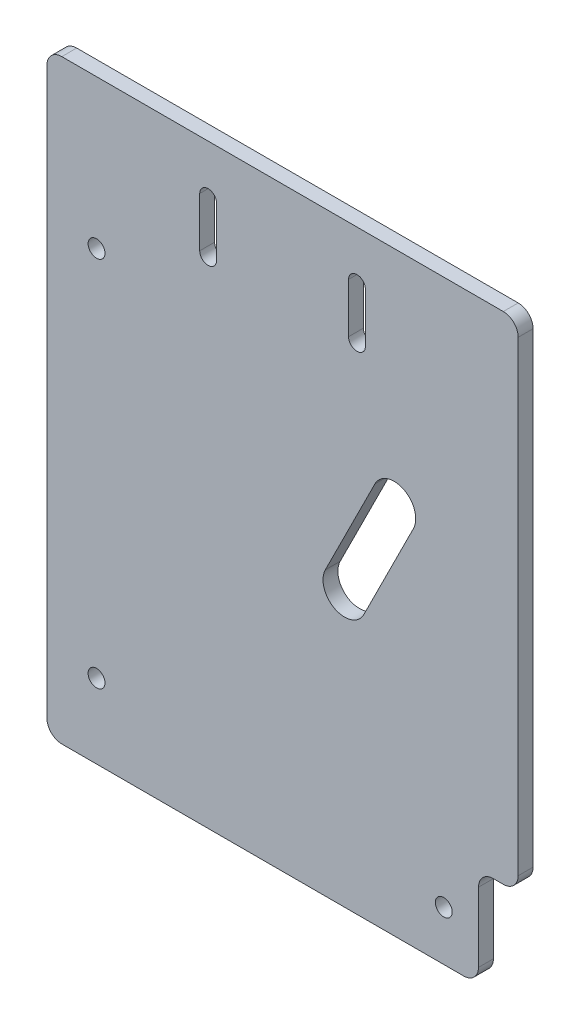
ISO-10303-21;
HEADER;
FILE_DESCRIPTION(('STEP AP214'),'2;1');
FILE_NAME('part.step','',(''),(''),'','','');
FILE_SCHEMA(('AUTOMOTIVE_DESIGN { 1 0 10303 214 1 1 1 1 }'));
ENDSEC;
DATA;
#1=APPLICATION_CONTEXT('core data for automotive mechanical design processes');
#2=APPLICATION_PROTOCOL_DEFINITION('international standard','automotive_design',2000,#1);
#3=PRODUCT_CONTEXT('',#1,'mechanical');
#4=PRODUCT('Part','Part','',(#3));
#5=PRODUCT_RELATED_PRODUCT_CATEGORY('part','',(#4));
#6=PRODUCT_DEFINITION_FORMATION('','',#4);
#7=PRODUCT_DEFINITION_CONTEXT('part definition',#1,'design');
#8=PRODUCT_DEFINITION('design','',#6,#7);
#9=PRODUCT_DEFINITION_SHAPE('','',#8);
#10=(LENGTH_UNIT() NAMED_UNIT(*) SI_UNIT(.MILLI.,.METRE.));
#11=(NAMED_UNIT(*) PLANE_ANGLE_UNIT() SI_UNIT($,.RADIAN.));
#12=(NAMED_UNIT(*) SI_UNIT($,.STERADIAN.) SOLID_ANGLE_UNIT());
#13=UNCERTAINTY_MEASURE_WITH_UNIT(LENGTH_MEASURE(1.E-05),#10,'distance_accuracy_value','');
#14=(GEOMETRIC_REPRESENTATION_CONTEXT(3) GLOBAL_UNCERTAINTY_ASSIGNED_CONTEXT((#13)) GLOBAL_UNIT_ASSIGNED_CONTEXT((#10,
#11,#12)) REPRESENTATION_CONTEXT('',''));
#15=CARTESIAN_POINT('',(0.,0.,0.));
#16=DIRECTION('',(0.,0.,1.));
#17=DIRECTION('',(1.,0.,0.));
#18=AXIS2_PLACEMENT_3D('',#15,#16,#17);
#19=CARTESIAN_POINT('',(70.,-45.,3.));
#20=DIRECTION('',(0.,0.,-1.));
#21=DIRECTION('',(-1.,0.,0.));
#22=AXIS2_PLACEMENT_3D('',#19,#20,#21);
#23=CYLINDRICAL_SURFACE('',#22,4.35);
#24=CARTESIAN_POINT('',(70.,-45.,0.));
#25=DIRECTION('',(0.,0.,1.));
#26=DIRECTION('',(1.,0.,0.));
#27=AXIS2_PLACEMENT_3D('',#24,#25,#26);
#28=CIRCLE('',#27,4.35);
#29=CARTESIAN_POINT('',(73.8907582808497,-46.9453791404248,0.));
#30=VERTEX_POINT('',#29);
#31=CARTESIAN_POINT('',(66.1092417191503,-43.0546208595752,0.));
#32=VERTEX_POINT('',#31);
#33=EDGE_CURVE('E310',#30,#32,#28,.T.);
#34=ORIENTED_EDGE('',*,*,#33,.F.);
#35=DIRECTION('',(0.,0.,-1.));
#36=VECTOR('',#35,1.);
#37=CARTESIAN_POINT('',(73.8907582808497,-46.9453791404248,3.));
#38=LINE('',#37,#36);
#39=CARTESIAN_POINT('',(73.8907582808497,-46.9453791404248,3.));
#40=VERTEX_POINT('',#39);
#41=EDGE_CURVE('E326',#40,#30,#38,.T.);
#42=ORIENTED_EDGE('',*,*,#41,.F.);
#43=CARTESIAN_POINT('',(70.,-45.,3.));
#44=DIRECTION('',(0.,0.,1.));
#45=DIRECTION('',(1.,0.,0.));
#46=AXIS2_PLACEMENT_3D('',#43,#44,#45);
#47=CIRCLE('',#46,4.35);
#48=CARTESIAN_POINT('',(66.1092417191503,-43.0546208595752,3.));
#49=VERTEX_POINT('',#48);
#50=EDGE_CURVE('E278',#40,#49,#47,.T.);
#51=ORIENTED_EDGE('',*,*,#50,.T.);
#52=DIRECTION('',(0.,0.,-1.));
#53=VECTOR('',#52,1.);
#54=CARTESIAN_POINT('',(66.1092417191503,-43.0546208595752,3.));
#55=LINE('',#54,#53);
#56=EDGE_CURVE('E290',#49,#32,#55,.T.);
#57=ORIENTED_EDGE('',*,*,#56,.T.);
#58=EDGE_LOOP('',(#34,#42,#51,#57));
#59=FACE_BOUND('',#58,.T.);
#60=ADVANCED_FACE('F37',(#59),#23,.F.);
#61=CARTESIAN_POINT('',(77.8907582808496,-38.9453791404248,3.));
#62=DIRECTION('',(-0.894427190999916,0.447213595499958,0.));
#63=DIRECTION('',(-0.447213595499958,-0.894427190999916,0.));
#64=AXIS2_PLACEMENT_3D('',#61,#62,#63);
#65=PLANE('',#64);
#66=DIRECTION('',(0.447213595499958,0.894427190999916,0.));
#67=VECTOR('',#66,1.);
#68=CARTESIAN_POINT('',(77.8907582808496,-38.9453791404248,0.));
#69=LINE('',#68,#67);
#70=CARTESIAN_POINT('',(63.8907582808496,-66.9453791404248,0.));
#71=VERTEX_POINT('',#70);
#72=EDGE_CURVE('E313',#71,#30,#69,.T.);
#73=ORIENTED_EDGE('',*,*,#72,.F.);
#74=DIRECTION('',(0.,0.,-1.));
#75=VECTOR('',#74,1.);
#76=CARTESIAN_POINT('',(63.8907582808496,-66.9453791404248,3.));
#77=LINE('',#76,#75);
#78=CARTESIAN_POINT('',(63.8907582808496,-66.9453791404248,3.));
#79=VERTEX_POINT('',#78);
#80=EDGE_CURVE('E324',#79,#71,#77,.T.);
#81=ORIENTED_EDGE('',*,*,#80,.F.);
#82=DIRECTION('',(0.447213595499958,0.894427190999916,0.));
#83=VECTOR('',#82,1.);
#84=CARTESIAN_POINT('',(77.8907582808496,-38.9453791404248,3.));
#85=LINE('',#84,#83);
#86=EDGE_CURVE('E281',#79,#40,#85,.T.);
#87=ORIENTED_EDGE('',*,*,#86,.T.);
#88=ORIENTED_EDGE('',*,*,#41,.T.);
#89=EDGE_LOOP('',(#73,#81,#87,#88));
#90=FACE_BOUND('',#89,.T.);
#91=ADVANCED_FACE('F462',(#90),#65,.T.);
#92=CARTESIAN_POINT('',(60.,-65.,3.));
#93=DIRECTION('',(0.,0.,-1.));
#94=DIRECTION('',(-1.,0.,0.));
#95=AXIS2_PLACEMENT_3D('',#92,#93,#94);
#96=CYLINDRICAL_SURFACE('',#95,4.34999999999999);
#97=CARTESIAN_POINT('',(60.,-65.,0.));
#98=DIRECTION('',(0.,0.,1.));
#99=DIRECTION('',(1.,0.,0.));
#100=AXIS2_PLACEMENT_3D('',#97,#98,#99);
#101=CIRCLE('',#100,4.34999999999999);
#102=CARTESIAN_POINT('',(56.1092417191504,-63.0546208595752,0.));
#103=VERTEX_POINT('',#102);
#104=EDGE_CURVE('E316',#103,#71,#101,.T.);
#105=ORIENTED_EDGE('',*,*,#104,.F.);
#106=DIRECTION('',(0.,0.,-1.));
#107=VECTOR('',#106,1.);
#108=CARTESIAN_POINT('',(56.1092417191504,-63.0546208595752,3.));
#109=LINE('',#108,#107);
#110=CARTESIAN_POINT('',(56.1092417191504,-63.0546208595752,3.));
#111=VERTEX_POINT('',#110);
#112=EDGE_CURVE('E322',#111,#103,#109,.T.);
#113=ORIENTED_EDGE('',*,*,#112,.F.);
#114=CARTESIAN_POINT('',(60.,-65.,3.));
#115=DIRECTION('',(0.,0.,1.));
#116=DIRECTION('',(1.,0.,0.));
#117=AXIS2_PLACEMENT_3D('',#114,#115,#116);
#118=CIRCLE('',#117,4.34999999999999);
#119=EDGE_CURVE('E284',#111,#79,#118,.T.);
#120=ORIENTED_EDGE('',*,*,#119,.T.);
#121=ORIENTED_EDGE('',*,*,#80,.T.);
#122=EDGE_LOOP('',(#105,#113,#120,#121));
#123=FACE_BOUND('',#122,.T.);
#124=ADVANCED_FACE('F468',(#123),#96,.F.);
#125=CARTESIAN_POINT('',(0.,-120.,3.));
#126=DIRECTION('',(0.,1.,0.));
#127=DIRECTION('',(-1.,0.,0.));
#128=AXIS2_PLACEMENT_3D('',#125,#126,#127);
#129=PLANE('',#128);
#130=DIRECTION('',(1.,0.,0.));
#131=VECTOR('',#130,1.);
#132=CARTESIAN_POINT('',(0.,-120.,0.));
#133=LINE('',#132,#131);
#134=CARTESIAN_POINT('',(3.00000000000001,-120.,0.));
#135=VERTEX_POINT('',#134);
#136=CARTESIAN_POINT('',(84.,-120.,0.));
#137=VERTEX_POINT('',#136);
#138=EDGE_CURVE('E250',#135,#137,#133,.T.);
#139=ORIENTED_EDGE('',*,*,#138,.T.);
#140=DIRECTION('',(0.,0.,1.));
#141=VECTOR('',#140,1.);
#142=CARTESIAN_POINT('',(84.,-120.,3.));
#143=LINE('',#142,#141);
#144=CARTESIAN_POINT('',(84.,-120.,3.));
#145=VERTEX_POINT('',#144);
#146=EDGE_CURVE('E376',#137,#145,#143,.T.);
#147=ORIENTED_EDGE('',*,*,#146,.T.);
#148=DIRECTION('',(1.,0.,0.));
#149=VECTOR('',#148,1.);
#150=CARTESIAN_POINT('',(0.,-120.,3.));
#151=LINE('',#150,#149);
#152=CARTESIAN_POINT('',(3.00000000000001,-120.,3.));
#153=VERTEX_POINT('',#152);
#154=EDGE_CURVE('E257',#153,#145,#151,.T.);
#155=ORIENTED_EDGE('',*,*,#154,.F.);
#156=DIRECTION('',(0.,0.,-1.));
#157=VECTOR('',#156,1.);
#158=CARTESIAN_POINT('',(3.00000000000001,-120.,3.));
#159=LINE('',#158,#157);
#160=EDGE_CURVE('E336',#153,#135,#159,.T.);
#161=ORIENTED_EDGE('',*,*,#160,.T.);
#162=EDGE_LOOP('',(#139,#147,#155,#161));
#163=FACE_BOUND('',#162,.T.);
#164=ADVANCED_FACE('F428',(#163),#129,.F.);
#165=CARTESIAN_POINT('',(95.,0.,3.));
#166=DIRECTION('',(1.,0.,0.));
#167=DIRECTION('',(0.,1.,0.));
#168=AXIS2_PLACEMENT_3D('',#165,#166,#167);
#169=PLANE('',#168);
#170=DIRECTION('',(0.,-1.,0.));
#171=VECTOR('',#170,1.);
#172=CARTESIAN_POINT('',(95.,0.,3.));
#173=LINE('',#172,#171);
#174=CARTESIAN_POINT('',(95.,-3.,3.));
#175=VERTEX_POINT('',#174);
#176=CARTESIAN_POINT('',(95.,-97.,3.));
#177=VERTEX_POINT('',#176);
#178=EDGE_CURVE('E260',#175,#177,#173,.T.);
#179=ORIENTED_EDGE('',*,*,#178,.T.);
#180=DIRECTION('',(0.,0.,1.));
#181=VECTOR('',#180,1.);
#182=CARTESIAN_POINT('',(95.,-97.,0.));
#183=LINE('',#182,#181);
#184=CARTESIAN_POINT('',(95.,-97.,0.));
#185=VERTEX_POINT('',#184);
#186=EDGE_CURVE('E52',#177,#185,#183,.F.);
#187=ORIENTED_EDGE('',*,*,#186,.T.);
#188=DIRECTION('',(0.,-1.,0.));
#189=VECTOR('',#188,1.);
#190=CARTESIAN_POINT('',(95.,0.,0.));
#191=LINE('',#190,#189);
#192=CARTESIAN_POINT('',(95.,-3.,0.));
#193=VERTEX_POINT('',#192);
#194=EDGE_CURVE('E293',#193,#185,#191,.T.);
#195=ORIENTED_EDGE('',*,*,#194,.F.);
#196=DIRECTION('',(0.,0.,-1.));
#197=VECTOR('',#196,1.);
#198=CARTESIAN_POINT('',(95.,-3.,3.));
#199=LINE('',#198,#197);
#200=EDGE_CURVE('E328',#193,#175,#199,.F.);
#201=ORIENTED_EDGE('',*,*,#200,.T.);
#202=EDGE_LOOP('',(#179,#187,#195,#201));
#203=FACE_BOUND('',#202,.T.);
#204=ADVANCED_FACE('F454',(#203),#169,.T.);
#205=CARTESIAN_POINT('',(0.,0.,3.));
#206=DIRECTION('',(0.,1.,0.));
#207=DIRECTION('',(0.,0.,1.));
#208=AXIS2_PLACEMENT_3D('',#205,#206,#207);
#209=PLANE('',#208);
#210=DIRECTION('',(1.,0.,0.));
#211=VECTOR('',#210,1.);
#212=CARTESIAN_POINT('',(0.,0.,3.));
#213=LINE('',#212,#211);
#214=CARTESIAN_POINT('',(3.,0.,3.));
#215=VERTEX_POINT('',#214);
#216=CARTESIAN_POINT('',(92.,0.,3.));
#217=VERTEX_POINT('',#216);
#218=EDGE_CURVE('E263',#215,#217,#213,.T.);
#219=ORIENTED_EDGE('',*,*,#218,.T.);
#220=DIRECTION('',(0.,0.,-1.));
#221=VECTOR('',#220,1.);
#222=CARTESIAN_POINT('',(92.,0.,3.));
#223=LINE('',#222,#221);
#224=CARTESIAN_POINT('',(92.,0.,0.));
#225=VERTEX_POINT('',#224);
#226=EDGE_CURVE('E352',#217,#225,#223,.T.);
#227=ORIENTED_EDGE('',*,*,#226,.T.);
#228=DIRECTION('',(1.,0.,0.));
#229=VECTOR('',#228,1.);
#230=CARTESIAN_POINT('',(0.,0.,0.));
#231=LINE('',#230,#229);
#232=CARTESIAN_POINT('',(3.,0.,0.));
#233=VERTEX_POINT('',#232);
#234=EDGE_CURVE('E295',#233,#225,#231,.T.);
#235=ORIENTED_EDGE('',*,*,#234,.F.);
#236=DIRECTION('',(0.,0.,-1.));
#237=VECTOR('',#236,1.);
#238=CARTESIAN_POINT('',(3.,0.,3.));
#239=LINE('',#238,#237);
#240=EDGE_CURVE('E350',#233,#215,#239,.F.);
#241=ORIENTED_EDGE('',*,*,#240,.T.);
#242=EDGE_LOOP('',(#219,#227,#235,#241));
#243=FACE_BOUND('',#242,.T.);
#244=ADVANCED_FACE('F446',(#243),#209,.T.);
#245=CARTESIAN_POINT('',(80.,-110.,3.));
#246=DIRECTION('',(0.,0.,-1.));
#247=DIRECTION('',(-1.,0.,0.));
#248=AXIS2_PLACEMENT_3D('',#245,#246,#247);
#249=CYLINDRICAL_SURFACE('',#248,1.70000000000001);
#250=CARTESIAN_POINT('',(80.,-110.,3.));
#251=DIRECTION('',(0.,0.,1.));
#252=DIRECTION('',(1.,0.,0.));
#253=AXIS2_PLACEMENT_3D('',#250,#251,#252);
#254=CIRCLE('',#253,1.70000000000001);
#255=CARTESIAN_POINT('',(81.7,-110.,3.));
#256=VERTEX_POINT('',#255);
#257=EDGE_CURVE('E275',#256,#256,#254,.T.);
#258=ORIENTED_EDGE('',*,*,#257,.T.);
#259=EDGE_LOOP('',(#258));
#260=FACE_BOUND('',#259,.T.);
#261=CARTESIAN_POINT('',(80.,-110.,0.));
#262=DIRECTION('',(0.,0.,1.));
#263=DIRECTION('',(1.,0.,0.));
#264=AXIS2_PLACEMENT_3D('',#261,#262,#263);
#265=CIRCLE('',#264,1.70000000000001);
#266=CARTESIAN_POINT('',(81.7,-110.,0.));
#267=VERTEX_POINT('',#266);
#268=EDGE_CURVE('E307',#267,#267,#265,.T.);
#269=ORIENTED_EDGE('',*,*,#268,.F.);
#270=EDGE_LOOP('',(#269));
#271=FACE_BOUND('',#270,.T.);
#272=ADVANCED_FACE('F474',(#260,#271),#249,.F.);
#273=CARTESIAN_POINT('',(9.99999999999996,-30.,3.));
#274=DIRECTION('',(0.,0.,-1.));
#275=DIRECTION('',(-1.,0.,0.));
#276=AXIS2_PLACEMENT_3D('',#273,#274,#275);
#277=CYLINDRICAL_SURFACE('',#276,1.7);
#278=CARTESIAN_POINT('',(9.99999999999996,-30.,3.));
#279=DIRECTION('',(0.,0.,1.));
#280=DIRECTION('',(1.,0.,0.));
#281=AXIS2_PLACEMENT_3D('',#278,#279,#280);
#282=CIRCLE('',#281,1.7);
#283=CARTESIAN_POINT('',(11.7,-30.,3.));
#284=VERTEX_POINT('',#283);
#285=EDGE_CURVE('E272',#284,#284,#282,.T.);
#286=ORIENTED_EDGE('',*,*,#285,.T.);
#287=EDGE_LOOP('',(#286));
#288=FACE_BOUND('',#287,.T.);
#289=CARTESIAN_POINT('',(9.99999999999996,-30.,0.));
#290=DIRECTION('',(0.,0.,1.));
#291=DIRECTION('',(1.,0.,0.));
#292=AXIS2_PLACEMENT_3D('',#289,#290,#291);
#293=CIRCLE('',#292,1.7);
#294=CARTESIAN_POINT('',(11.7,-30.,0.));
#295=VERTEX_POINT('',#294);
#296=EDGE_CURVE('E304',#295,#295,#293,.T.);
#297=ORIENTED_EDGE('',*,*,#296,.F.);
#298=EDGE_LOOP('',(#297));
#299=FACE_BOUND('',#298,.T.);
#300=ADVANCED_FACE('F477',(#288,#299),#277,.F.);
#301=CARTESIAN_POINT('',(9.99999999999996,-105.,3.));
#302=DIRECTION('',(0.,0.,-1.));
#303=DIRECTION('',(-1.,0.,0.));
#304=AXIS2_PLACEMENT_3D('',#301,#302,#303);
#305=CYLINDRICAL_SURFACE('',#304,1.70000000000001);
#306=CARTESIAN_POINT('',(9.99999999999996,-105.,3.));
#307=DIRECTION('',(0.,0.,1.));
#308=DIRECTION('',(1.,0.,0.));
#309=AXIS2_PLACEMENT_3D('',#306,#307,#308);
#310=CIRCLE('',#309,1.70000000000001);
#311=CARTESIAN_POINT('',(11.7,-105.,3.));
#312=VERTEX_POINT('',#311);
#313=EDGE_CURVE('E269',#312,#312,#310,.T.);
#314=ORIENTED_EDGE('',*,*,#313,.T.);
#315=EDGE_LOOP('',(#314));
#316=FACE_BOUND('',#315,.T.);
#317=CARTESIAN_POINT('',(9.99999999999996,-105.,0.));
#318=DIRECTION('',(0.,0.,1.));
#319=DIRECTION('',(1.,0.,0.));
#320=AXIS2_PLACEMENT_3D('',#317,#318,#319);
#321=CIRCLE('',#320,1.70000000000001);
#322=CARTESIAN_POINT('',(11.7,-105.,0.));
#323=VERTEX_POINT('',#322);
#324=EDGE_CURVE('E301',#323,#323,#321,.T.);
#325=ORIENTED_EDGE('',*,*,#324,.F.);
#326=EDGE_LOOP('',(#325));
#327=FACE_BOUND('',#326,.T.);
#328=ADVANCED_FACE('F481',(#316,#327),#305,.F.);
#329=CARTESIAN_POINT('',(0.,0.,3.));
#330=DIRECTION('',(1.,0.,0.));
#331=DIRECTION('',(0.,1.,0.));
#332=AXIS2_PLACEMENT_3D('',#329,#330,#331);
#333=PLANE('',#332);
#334=DIRECTION('',(0.,-1.,0.));
#335=VECTOR('',#334,1.);
#336=CARTESIAN_POINT('',(0.,0.,0.));
#337=LINE('',#336,#335);
#338=CARTESIAN_POINT('',(0.,-3.,0.));
#339=VERTEX_POINT('',#338);
#340=CARTESIAN_POINT('',(0.,-117.,0.));
#341=VERTEX_POINT('',#340);
#342=EDGE_CURVE('E298',#339,#341,#337,.T.);
#343=ORIENTED_EDGE('',*,*,#342,.T.);
#344=DIRECTION('',(0.,0.,-1.));
#345=VECTOR('',#344,1.);
#346=CARTESIAN_POINT('',(0.,-117.,3.));
#347=LINE('',#346,#345);
#348=CARTESIAN_POINT('',(0.,-117.,3.));
#349=VERTEX_POINT('',#348);
#350=EDGE_CURVE('E348',#341,#349,#347,.F.);
#351=ORIENTED_EDGE('',*,*,#350,.T.);
#352=DIRECTION('',(0.,-1.,0.));
#353=VECTOR('',#352,1.);
#354=CARTESIAN_POINT('',(0.,0.,3.));
#355=LINE('',#354,#353);
#356=CARTESIAN_POINT('',(0.,-3.,3.));
#357=VERTEX_POINT('',#356);
#358=EDGE_CURVE('E266',#357,#349,#355,.T.);
#359=ORIENTED_EDGE('',*,*,#358,.F.);
#360=DIRECTION('',(0.,0.,-1.));
#361=VECTOR('',#360,1.);
#362=CARTESIAN_POINT('',(0.,-3.,0.));
#363=LINE('',#362,#361);
#364=EDGE_CURVE('E345',#357,#339,#363,.T.);
#365=ORIENTED_EDGE('',*,*,#364,.T.);
#366=EDGE_LOOP('',(#343,#351,#359,#365));
#367=FACE_BOUND('',#366,.T.);
#368=ADVANCED_FACE('F437',(#367),#333,.F.);
#369=CARTESIAN_POINT('',(70.1092417191504,-35.0546208595751,3.));
#370=DIRECTION('',(0.894427190999916,-0.447213595499957,0.));
#371=DIRECTION('',(0.447213595499957,0.894427190999916,0.));
#372=AXIS2_PLACEMENT_3D('',#369,#370,#371);
#373=PLANE('',#372);
#374=DIRECTION('',(-0.447213595499957,-0.894427190999916,0.));
#375=VECTOR('',#374,1.);
#376=CARTESIAN_POINT('',(70.1092417191504,-35.0546208595751,0.));
#377=LINE('',#376,#375);
#378=EDGE_CURVE('E261',#32,#103,#377,.T.);
#379=ORIENTED_EDGE('',*,*,#378,.F.);
#380=ORIENTED_EDGE('',*,*,#56,.F.);
#381=DIRECTION('',(-0.447213595499957,-0.894427190999916,0.));
#382=VECTOR('',#381,1.);
#383=CARTESIAN_POINT('',(70.1092417191504,-35.0546208595751,3.));
#384=LINE('',#383,#382);
#385=EDGE_CURVE('E287',#49,#111,#384,.T.);
#386=ORIENTED_EDGE('',*,*,#385,.T.);
#387=ORIENTED_EDGE('',*,*,#112,.T.);
#388=EDGE_LOOP('',(#379,#380,#386,#387));
#389=FACE_BOUND('',#388,.T.);
#390=ADVANCED_FACE('F488',(#389),#373,.T.);
#391=CARTESIAN_POINT('',(0.,0.,3.));
#392=DIRECTION('',(0.,0.,1.));
#393=DIRECTION('',(1.,0.,0.));
#394=AXIS2_PLACEMENT_3D('',#391,#392,#393);
#395=PLANE('',#394);
#396=ORIENTED_EDGE('',*,*,#154,.T.);
#397=CARTESIAN_POINT('',(84.,-117.,3.));
#398=DIRECTION('',(0.,0.,1.));
#399=DIRECTION('',(1.,0.,0.));
#400=AXIS2_PLACEMENT_3D('',#397,#398,#399);
#401=CIRCLE('',#400,3.);
#402=CARTESIAN_POINT('',(87.,-117.,3.));
#403=VERTEX_POINT('',#402);
#404=EDGE_CURVE('E381',#145,#403,#401,.T.);
#405=ORIENTED_EDGE('',*,*,#404,.T.);
#406=DIRECTION('',(0.,-1.,0.));
#407=VECTOR('',#406,1.);
#408=CARTESIAN_POINT('',(87.,-100.,3.));
#409=LINE('',#408,#407);
#410=CARTESIAN_POINT('',(87.,-103.,3.));
#411=VERTEX_POINT('',#410);
#412=EDGE_CURVE('E401',#411,#403,#409,.T.);
#413=ORIENTED_EDGE('',*,*,#412,.F.);
#414=CARTESIAN_POINT('',(90.,-103.,3.));
#415=DIRECTION('',(0.,0.,1.));
#416=DIRECTION('',(1.,0.,0.));
#417=AXIS2_PLACEMENT_3D('',#414,#415,#416);
#418=CIRCLE('',#417,3.);
#419=CARTESIAN_POINT('',(90.,-100.,3.));
#420=VERTEX_POINT('',#419);
#421=EDGE_CURVE('E45',#411,#420,#418,.F.);
#422=ORIENTED_EDGE('',*,*,#421,.T.);
#423=DIRECTION('',(-1.,0.,0.));
#424=VECTOR('',#423,1.);
#425=CARTESIAN_POINT('',(95.,-100.,3.));
#426=LINE('',#425,#424);
#427=CARTESIAN_POINT('',(92.,-100.,3.));
#428=VERTEX_POINT('',#427);
#429=EDGE_CURVE('E399',#428,#420,#426,.T.);
#430=ORIENTED_EDGE('',*,*,#429,.F.);
#431=CARTESIAN_POINT('',(92.,-97.,3.));
#432=DIRECTION('',(0.,0.,1.));
#433=DIRECTION('',(1.,0.,0.));
#434=AXIS2_PLACEMENT_3D('',#431,#432,#433);
#435=CIRCLE('',#434,3.);
#436=EDGE_CURVE('E379',#428,#177,#435,.T.);
#437=ORIENTED_EDGE('',*,*,#436,.T.);
#438=ORIENTED_EDGE('',*,*,#178,.F.);
#439=CARTESIAN_POINT('',(92.,-3.,3.));
#440=DIRECTION('',(0.,0.,1.));
#441=DIRECTION('',(1.,0.,0.));
#442=AXIS2_PLACEMENT_3D('',#439,#440,#441);
#443=CIRCLE('',#442,3.);
#444=EDGE_CURVE('E341',#175,#217,#443,.T.);
#445=ORIENTED_EDGE('',*,*,#444,.T.);
#446=ORIENTED_EDGE('',*,*,#218,.F.);
#447=CARTESIAN_POINT('',(3.,-3.,3.));
#448=DIRECTION('',(0.,0.,1.));
#449=DIRECTION('',(1.,0.,0.));
#450=AXIS2_PLACEMENT_3D('',#447,#448,#449);
#451=CIRCLE('',#450,3.);
#452=EDGE_CURVE('E339',#215,#357,#451,.T.);
#453=ORIENTED_EDGE('',*,*,#452,.T.);
#454=ORIENTED_EDGE('',*,*,#358,.T.);
#455=CARTESIAN_POINT('',(3.00000000000001,-117.,3.));
#456=DIRECTION('',(0.,0.,1.));
#457=DIRECTION('',(1.,0.,0.));
#458=AXIS2_PLACEMENT_3D('',#455,#456,#457);
#459=CIRCLE('',#458,3.);
#460=EDGE_CURVE('E343',#349,#153,#459,.T.);
#461=ORIENTED_EDGE('',*,*,#460,.T.);
#462=EDGE_LOOP('',(#396,#405,#413,#422,#430,#437,#438,#445,#446,#453,#454,#461));
#463=FACE_BOUND('',#462,.T.);
#464=CARTESIAN_POINT('',(62.5,-9.99999999999999,3.));
#465=DIRECTION('',(0.,0.,1.));
#466=DIRECTION('',(1.,0.,0.));
#467=AXIS2_PLACEMENT_3D('',#464,#465,#466);
#468=CIRCLE('',#467,1.70000000000001);
#469=CARTESIAN_POINT('',(64.2,-9.99999999999999,3.));
#470=VERTEX_POINT('',#469);
#471=CARTESIAN_POINT('',(60.8,-9.99999999999999,3.));
#472=VERTEX_POINT('',#471);
#473=EDGE_CURVE('E222',#470,#472,#468,.T.);
#474=ORIENTED_EDGE('',*,*,#473,.F.);
#475=DIRECTION('',(0.,1.,0.));
#476=VECTOR('',#475,1.);
#477=CARTESIAN_POINT('',(64.2,-9.99999999999999,3.));
#478=LINE('',#477,#476);
#479=CARTESIAN_POINT('',(64.2,-20.,3.));
#480=VERTEX_POINT('',#479);
#481=EDGE_CURVE('E227',#480,#470,#478,.T.);
#482=ORIENTED_EDGE('',*,*,#481,.F.);
#483=CARTESIAN_POINT('',(62.5,-20.,3.));
#484=DIRECTION('',(0.,0.,1.));
#485=DIRECTION('',(1.,0.,0.));
#486=AXIS2_PLACEMENT_3D('',#483,#484,#485);
#487=CIRCLE('',#486,1.7);
#488=CARTESIAN_POINT('',(60.8,-20.,3.));
#489=VERTEX_POINT('',#488);
#490=EDGE_CURVE('E206',#489,#480,#487,.T.);
#491=ORIENTED_EDGE('',*,*,#490,.F.);
#492=DIRECTION('',(0.,-1.,0.));
#493=VECTOR('',#492,1.);
#494=CARTESIAN_POINT('',(60.8,-9.99999999999999,3.));
#495=LINE('',#494,#493);
#496=EDGE_CURVE('E217',#472,#489,#495,.T.);
#497=ORIENTED_EDGE('',*,*,#496,.F.);
#498=EDGE_LOOP('',(#474,#482,#491,#497));
#499=FACE_BOUND('',#498,.T.);
#500=CARTESIAN_POINT('',(32.5,-10.,3.));
#501=DIRECTION('',(0.,0.,1.));
#502=DIRECTION('',(1.,0.,0.));
#503=AXIS2_PLACEMENT_3D('',#500,#501,#502);
#504=CIRCLE('',#503,1.7);
#505=CARTESIAN_POINT('',(34.2,-10.,3.));
#506=VERTEX_POINT('',#505);
#507=CARTESIAN_POINT('',(30.8,-10.,3.));
#508=VERTEX_POINT('',#507);
#509=EDGE_CURVE('E234',#506,#508,#504,.T.);
#510=ORIENTED_EDGE('',*,*,#509,.F.);
#511=DIRECTION('',(0.,1.,0.));
#512=VECTOR('',#511,1.);
#513=CARTESIAN_POINT('',(34.2,-10.,3.));
#514=LINE('',#513,#512);
#515=CARTESIAN_POINT('',(34.2,-20.,3.));
#516=VERTEX_POINT('',#515);
#517=EDGE_CURVE('E244',#516,#506,#514,.T.);
#518=ORIENTED_EDGE('',*,*,#517,.F.);
#519=CARTESIAN_POINT('',(32.5,-20.,3.));
#520=DIRECTION('',(0.,0.,1.));
#521=DIRECTION('',(1.,0.,0.));
#522=AXIS2_PLACEMENT_3D('',#519,#520,#521);
#523=CIRCLE('',#522,1.7);
#524=CARTESIAN_POINT('',(30.8,-20.,3.));
#525=VERTEX_POINT('',#524);
#526=EDGE_CURVE('E241',#525,#516,#523,.T.);
#527=ORIENTED_EDGE('',*,*,#526,.F.);
#528=DIRECTION('',(0.,-1.,0.));
#529=VECTOR('',#528,1.);
#530=CARTESIAN_POINT('',(30.8,-10.,3.));
#531=LINE('',#530,#529);
#532=EDGE_CURVE('E238',#508,#525,#531,.T.);
#533=ORIENTED_EDGE('',*,*,#532,.F.);
#534=EDGE_LOOP('',(#510,#518,#527,#533));
#535=FACE_BOUND('',#534,.T.);
#536=ORIENTED_EDGE('',*,*,#313,.F.);
#537=EDGE_LOOP('',(#536));
#538=FACE_BOUND('',#537,.T.);
#539=ORIENTED_EDGE('',*,*,#285,.F.);
#540=EDGE_LOOP('',(#539));
#541=FACE_BOUND('',#540,.T.);
#542=ORIENTED_EDGE('',*,*,#257,.F.);
#543=EDGE_LOOP('',(#542));
#544=FACE_BOUND('',#543,.T.);
#545=ORIENTED_EDGE('',*,*,#50,.F.);
#546=ORIENTED_EDGE('',*,*,#86,.F.);
#547=ORIENTED_EDGE('',*,*,#119,.F.);
#548=ORIENTED_EDGE('',*,*,#385,.F.);
#549=EDGE_LOOP('',(#545,#546,#547,#548));
#550=FACE_BOUND('',#549,.T.);
#551=ADVANCED_FACE('F224',(#463,#499,#535,#538,#541,#544,#550),#395,.T.);
#552=CARTESIAN_POINT('',(0.,0.,0.));
#553=DIRECTION('',(0.,0.,1.));
#554=DIRECTION('',(1.,0.,0.));
#555=AXIS2_PLACEMENT_3D('',#552,#553,#554);
#556=PLANE('',#555);
#557=DIRECTION('',(0.,1.,0.));
#558=VECTOR('',#557,1.);
#559=CARTESIAN_POINT('',(64.2,0.,0.));
#560=LINE('',#559,#558);
#561=CARTESIAN_POINT('',(64.2,-20.,0.));
#562=VERTEX_POINT('',#561);
#563=CARTESIAN_POINT('',(64.2,-9.99999999999999,0.));
#564=VERTEX_POINT('',#563);
#565=EDGE_CURVE('E370',#562,#564,#560,.T.);
#566=ORIENTED_EDGE('',*,*,#565,.T.);
#567=CARTESIAN_POINT('',(62.5,-9.99999999999999,0.));
#568=DIRECTION('',(0.,0.,1.));
#569=DIRECTION('',(1.,0.,0.));
#570=AXIS2_PLACEMENT_3D('',#567,#568,#569);
#571=CIRCLE('',#570,1.70000000000001);
#572=CARTESIAN_POINT('',(60.8,-9.99999999999999,0.));
#573=VERTEX_POINT('',#572);
#574=EDGE_CURVE('E373',#564,#573,#571,.T.);
#575=ORIENTED_EDGE('',*,*,#574,.T.);
#576=DIRECTION('',(0.,-1.,0.));
#577=VECTOR('',#576,1.);
#578=CARTESIAN_POINT('',(60.8,0.,0.));
#579=LINE('',#578,#577);
#580=CARTESIAN_POINT('',(60.8,-20.,0.));
#581=VERTEX_POINT('',#580);
#582=EDGE_CURVE('E367',#573,#581,#579,.T.);
#583=ORIENTED_EDGE('',*,*,#582,.T.);
#584=CARTESIAN_POINT('',(62.5,-20.,0.));
#585=DIRECTION('',(0.,0.,1.));
#586=DIRECTION('',(1.,0.,0.));
#587=AXIS2_PLACEMENT_3D('',#584,#585,#586);
#588=CIRCLE('',#587,1.7);
#589=EDGE_CURVE('E209',#581,#562,#588,.T.);
#590=ORIENTED_EDGE('',*,*,#589,.T.);
#591=EDGE_LOOP('',(#566,#575,#583,#590));
#592=FACE_BOUND('',#591,.T.);
#593=DIRECTION('',(0.,1.,0.));
#594=VECTOR('',#593,1.);
#595=CARTESIAN_POINT('',(34.2,0.,0.));
#596=LINE('',#595,#594);
#597=CARTESIAN_POINT('',(34.2,-20.,0.));
#598=VERTEX_POINT('',#597);
#599=CARTESIAN_POINT('',(34.2,-10.,0.));
#600=VERTEX_POINT('',#599);
#601=EDGE_CURVE('E361',#598,#600,#596,.T.);
#602=ORIENTED_EDGE('',*,*,#601,.T.);
#603=CARTESIAN_POINT('',(32.5,-10.,0.));
#604=DIRECTION('',(0.,0.,1.));
#605=DIRECTION('',(1.,0.,0.));
#606=AXIS2_PLACEMENT_3D('',#603,#604,#605);
#607=CIRCLE('',#606,1.7);
#608=CARTESIAN_POINT('',(30.8,-10.,0.));
#609=VERTEX_POINT('',#608);
#610=EDGE_CURVE('E364',#600,#609,#607,.T.);
#611=ORIENTED_EDGE('',*,*,#610,.T.);
#612=DIRECTION('',(0.,-1.,0.));
#613=VECTOR('',#612,1.);
#614=CARTESIAN_POINT('',(30.8,0.,0.));
#615=LINE('',#614,#613);
#616=CARTESIAN_POINT('',(30.8,-20.,0.));
#617=VERTEX_POINT('',#616);
#618=EDGE_CURVE('E355',#609,#617,#615,.T.);
#619=ORIENTED_EDGE('',*,*,#618,.T.);
#620=CARTESIAN_POINT('',(32.5,-20.,0.));
#621=DIRECTION('',(0.,0.,1.));
#622=DIRECTION('',(1.,0.,0.));
#623=AXIS2_PLACEMENT_3D('',#620,#621,#622);
#624=CIRCLE('',#623,1.7);
#625=EDGE_CURVE('E358',#617,#598,#624,.T.);
#626=ORIENTED_EDGE('',*,*,#625,.T.);
#627=EDGE_LOOP('',(#602,#611,#619,#626));
#628=FACE_BOUND('',#627,.T.);
#629=DIRECTION('',(0.,-1.,0.));
#630=VECTOR('',#629,1.);
#631=CARTESIAN_POINT('',(87.,-100.,0.));
#632=LINE('',#631,#630);
#633=CARTESIAN_POINT('',(87.,-103.,0.));
#634=VERTEX_POINT('',#633);
#635=CARTESIAN_POINT('',(87.,-117.,0.));
#636=VERTEX_POINT('',#635);
#637=EDGE_CURVE('E414',#634,#636,#632,.T.);
#638=ORIENTED_EDGE('',*,*,#637,.T.);
#639=CARTESIAN_POINT('',(84.,-117.,0.));
#640=DIRECTION('',(0.,0.,1.));
#641=DIRECTION('',(1.,0.,0.));
#642=AXIS2_PLACEMENT_3D('',#639,#640,#641);
#643=CIRCLE('',#642,3.);
#644=EDGE_CURVE('E390',#636,#137,#643,.F.);
#645=ORIENTED_EDGE('',*,*,#644,.T.);
#646=ORIENTED_EDGE('',*,*,#138,.F.);
#647=CARTESIAN_POINT('',(3.00000000000001,-117.,0.));
#648=DIRECTION('',(0.,0.,1.));
#649=DIRECTION('',(1.,0.,0.));
#650=AXIS2_PLACEMENT_3D('',#647,#648,#649);
#651=CIRCLE('',#650,3.);
#652=EDGE_CURVE('E334',#135,#341,#651,.F.);
#653=ORIENTED_EDGE('',*,*,#652,.T.);
#654=ORIENTED_EDGE('',*,*,#342,.F.);
#655=CARTESIAN_POINT('',(3.,-3.,0.));
#656=DIRECTION('',(0.,0.,1.));
#657=DIRECTION('',(1.,0.,0.));
#658=AXIS2_PLACEMENT_3D('',#655,#656,#657);
#659=CIRCLE('',#658,3.);
#660=EDGE_CURVE('E330',#339,#233,#659,.F.);
#661=ORIENTED_EDGE('',*,*,#660,.T.);
#662=ORIENTED_EDGE('',*,*,#234,.T.);
#663=CARTESIAN_POINT('',(92.,-3.,0.));
#664=DIRECTION('',(0.,0.,1.));
#665=DIRECTION('',(1.,0.,0.));
#666=AXIS2_PLACEMENT_3D('',#663,#664,#665);
#667=CIRCLE('',#666,3.);
#668=EDGE_CURVE('E332',#225,#193,#667,.F.);
#669=ORIENTED_EDGE('',*,*,#668,.T.);
#670=ORIENTED_EDGE('',*,*,#194,.T.);
#671=CARTESIAN_POINT('',(92.,-97.,0.));
#672=DIRECTION('',(0.,0.,1.));
#673=DIRECTION('',(1.,0.,0.));
#674=AXIS2_PLACEMENT_3D('',#671,#672,#673);
#675=CIRCLE('',#674,3.);
#676=CARTESIAN_POINT('',(92.,-100.,0.));
#677=VERTEX_POINT('',#676);
#678=EDGE_CURVE('E388',#185,#677,#675,.F.);
#679=ORIENTED_EDGE('',*,*,#678,.T.);
#680=DIRECTION('',(-1.,0.,0.));
#681=VECTOR('',#680,1.);
#682=CARTESIAN_POINT('',(95.,-100.,0.));
#683=LINE('',#682,#681);
#684=CARTESIAN_POINT('',(90.,-100.,0.));
#685=VERTEX_POINT('',#684);
#686=EDGE_CURVE('E416',#677,#685,#683,.T.);
#687=ORIENTED_EDGE('',*,*,#686,.T.);
#688=CARTESIAN_POINT('',(90.,-103.,0.));
#689=DIRECTION('',(0.,0.,1.));
#690=DIRECTION('',(1.,0.,0.));
#691=AXIS2_PLACEMENT_3D('',#688,#689,#690);
#692=CIRCLE('',#691,3.);
#693=EDGE_CURVE('E11',#685,#634,#692,.T.);
#694=ORIENTED_EDGE('',*,*,#693,.T.);
#695=EDGE_LOOP('',(#638,#645,#646,#653,#654,#661,#662,#669,#670,#679,#687,#694));
#696=FACE_BOUND('',#695,.T.);
#697=ORIENTED_EDGE('',*,*,#324,.T.);
#698=EDGE_LOOP('',(#697));
#699=FACE_BOUND('',#698,.T.);
#700=ORIENTED_EDGE('',*,*,#296,.T.);
#701=EDGE_LOOP('',(#700));
#702=FACE_BOUND('',#701,.T.);
#703=ORIENTED_EDGE('',*,*,#268,.T.);
#704=EDGE_LOOP('',(#703));
#705=FACE_BOUND('',#704,.T.);
#706=ORIENTED_EDGE('',*,*,#33,.T.);
#707=ORIENTED_EDGE('',*,*,#378,.T.);
#708=ORIENTED_EDGE('',*,*,#104,.T.);
#709=ORIENTED_EDGE('',*,*,#72,.T.);
#710=EDGE_LOOP('',(#706,#707,#708,#709));
#711=FACE_BOUND('',#710,.T.);
#712=ADVANCED_FACE('F412',(#592,#628,#696,#699,#702,#705,#711),#556,.F.);
#713=CARTESIAN_POINT('',(3.00000000000001,-117.,3.));
#714=DIRECTION('',(0.,0.,-1.));
#715=DIRECTION('',(-1.,0.,0.));
#716=AXIS2_PLACEMENT_3D('',#713,#714,#715);
#717=CYLINDRICAL_SURFACE('',#716,3.);
#718=ORIENTED_EDGE('',*,*,#460,.F.);
#719=ORIENTED_EDGE('',*,*,#350,.F.);
#720=ORIENTED_EDGE('',*,*,#652,.F.);
#721=ORIENTED_EDGE('',*,*,#160,.F.);
#722=EDGE_LOOP('',(#718,#719,#720,#721));
#723=FACE_BOUND('',#722,.T.);
#724=ADVANCED_FACE('F433',(#723),#717,.T.);
#725=CARTESIAN_POINT('',(92.,-3.,3.));
#726=DIRECTION('',(0.,0.,-1.));
#727=DIRECTION('',(-1.,0.,0.));
#728=AXIS2_PLACEMENT_3D('',#725,#726,#727);
#729=CYLINDRICAL_SURFACE('',#728,3.);
#730=ORIENTED_EDGE('',*,*,#444,.F.);
#731=ORIENTED_EDGE('',*,*,#200,.F.);
#732=ORIENTED_EDGE('',*,*,#668,.F.);
#733=ORIENTED_EDGE('',*,*,#226,.F.);
#734=EDGE_LOOP('',(#730,#731,#732,#733));
#735=FACE_BOUND('',#734,.T.);
#736=ADVANCED_FACE('F451',(#735),#729,.T.);
#737=CARTESIAN_POINT('',(3.,-3.,3.));
#738=DIRECTION('',(0.,0.,1.));
#739=DIRECTION('',(1.,0.,0.));
#740=AXIS2_PLACEMENT_3D('',#737,#738,#739);
#741=CYLINDRICAL_SURFACE('',#740,3.);
#742=ORIENTED_EDGE('',*,*,#452,.F.);
#743=ORIENTED_EDGE('',*,*,#240,.F.);
#744=ORIENTED_EDGE('',*,*,#660,.F.);
#745=ORIENTED_EDGE('',*,*,#364,.F.);
#746=EDGE_LOOP('',(#742,#743,#744,#745));
#747=FACE_BOUND('',#746,.T.);
#748=ADVANCED_FACE('F442',(#747),#741,.T.);
#749=CARTESIAN_POINT('',(32.5,-10.,-7.));
#750=DIRECTION('',(0.,0.,1.));
#751=DIRECTION('',(1.,0.,0.));
#752=AXIS2_PLACEMENT_3D('',#749,#750,#751);
#753=CYLINDRICAL_SURFACE('',#752,1.7);
#754=DIRECTION('',(0.,0.,1.));
#755=VECTOR('',#754,1.);
#756=CARTESIAN_POINT('',(34.2,-10.,-7.));
#757=LINE('',#756,#755);
#758=EDGE_CURVE('E248',#600,#506,#757,.T.);
#759=ORIENTED_EDGE('',*,*,#758,.T.);
#760=ORIENTED_EDGE('',*,*,#509,.T.);
#761=DIRECTION('',(0.,0.,1.));
#762=VECTOR('',#761,1.);
#763=CARTESIAN_POINT('',(30.8,-10.,-7.));
#764=LINE('',#763,#762);
#765=EDGE_CURVE('E247',#609,#508,#764,.T.);
#766=ORIENTED_EDGE('',*,*,#765,.F.);
#767=ORIENTED_EDGE('',*,*,#610,.F.);
#768=EDGE_LOOP('',(#759,#760,#766,#767));
#769=FACE_BOUND('',#768,.T.);
#770=ADVANCED_FACE('F501',(#769),#753,.F.);
#771=CARTESIAN_POINT('',(34.2,-10.,-7.));
#772=DIRECTION('',(1.,0.,0.));
#773=DIRECTION('',(0.,1.,0.));
#774=AXIS2_PLACEMENT_3D('',#771,#772,#773);
#775=PLANE('',#774);
#776=DIRECTION('',(0.,0.,1.));
#777=VECTOR('',#776,1.);
#778=CARTESIAN_POINT('',(34.2,-20.,-7.));
#779=LINE('',#778,#777);
#780=EDGE_CURVE('E251',#598,#516,#779,.T.);
#781=ORIENTED_EDGE('',*,*,#780,.T.);
#782=ORIENTED_EDGE('',*,*,#517,.T.);
#783=ORIENTED_EDGE('',*,*,#758,.F.);
#784=ORIENTED_EDGE('',*,*,#601,.F.);
#785=EDGE_LOOP('',(#781,#782,#783,#784));
#786=FACE_BOUND('',#785,.T.);
#787=ADVANCED_FACE('F525',(#786),#775,.F.);
#788=CARTESIAN_POINT('',(32.5,-20.,-7.));
#789=DIRECTION('',(0.,0.,1.));
#790=DIRECTION('',(1.,0.,0.));
#791=AXIS2_PLACEMENT_3D('',#788,#789,#790);
#792=CYLINDRICAL_SURFACE('',#791,1.7);
#793=DIRECTION('',(0.,0.,1.));
#794=VECTOR('',#793,1.);
#795=CARTESIAN_POINT('',(30.8,-20.,-7.));
#796=LINE('',#795,#794);
#797=EDGE_CURVE('E253',#617,#525,#796,.T.);
#798=ORIENTED_EDGE('',*,*,#797,.T.);
#799=ORIENTED_EDGE('',*,*,#526,.T.);
#800=ORIENTED_EDGE('',*,*,#780,.F.);
#801=ORIENTED_EDGE('',*,*,#625,.F.);
#802=EDGE_LOOP('',(#798,#799,#800,#801));
#803=FACE_BOUND('',#802,.T.);
#804=ADVANCED_FACE('F528',(#803),#792,.F.);
#805=CARTESIAN_POINT('',(30.8,-10.,-7.));
#806=DIRECTION('',(-1.,0.,0.));
#807=DIRECTION('',(0.,-1.,0.));
#808=AXIS2_PLACEMENT_3D('',#805,#806,#807);
#809=PLANE('',#808);
#810=ORIENTED_EDGE('',*,*,#765,.T.);
#811=ORIENTED_EDGE('',*,*,#532,.T.);
#812=ORIENTED_EDGE('',*,*,#797,.F.);
#813=ORIENTED_EDGE('',*,*,#618,.F.);
#814=EDGE_LOOP('',(#810,#811,#812,#813));
#815=FACE_BOUND('',#814,.T.);
#816=ADVANCED_FACE('F523',(#815),#809,.F.);
#817=CARTESIAN_POINT('',(62.5,-9.99999999999999,-7.));
#818=DIRECTION('',(0.,0.,1.));
#819=DIRECTION('',(1.,0.,0.));
#820=AXIS2_PLACEMENT_3D('',#817,#818,#819);
#821=CYLINDRICAL_SURFACE('',#820,1.70000000000001);
#822=DIRECTION('',(0.,0.,1.));
#823=VECTOR('',#822,1.);
#824=CARTESIAN_POINT('',(64.2,-9.99999999999999,-7.));
#825=LINE('',#824,#823);
#826=EDGE_CURVE('E232',#564,#470,#825,.T.);
#827=ORIENTED_EDGE('',*,*,#826,.T.);
#828=ORIENTED_EDGE('',*,*,#473,.T.);
#829=DIRECTION('',(0.,0.,1.));
#830=VECTOR('',#829,1.);
#831=CARTESIAN_POINT('',(60.8,-9.99999999999999,-7.));
#832=LINE('',#831,#830);
#833=EDGE_CURVE('E213',#573,#472,#832,.T.);
#834=ORIENTED_EDGE('',*,*,#833,.F.);
#835=ORIENTED_EDGE('',*,*,#574,.F.);
#836=EDGE_LOOP('',(#827,#828,#834,#835));
#837=FACE_BOUND('',#836,.T.);
#838=ADVANCED_FACE('F515',(#837),#821,.F.);
#839=CARTESIAN_POINT('',(64.2,-9.99999999999999,-7.));
#840=DIRECTION('',(1.,0.,0.));
#841=DIRECTION('',(0.,1.,0.));
#842=AXIS2_PLACEMENT_3D('',#839,#840,#841);
#843=PLANE('',#842);
#844=DIRECTION('',(0.,0.,1.));
#845=VECTOR('',#844,1.);
#846=CARTESIAN_POINT('',(64.2,-20.,-7.));
#847=LINE('',#846,#845);
#848=EDGE_CURVE('E212',#562,#480,#847,.T.);
#849=ORIENTED_EDGE('',*,*,#848,.T.);
#850=ORIENTED_EDGE('',*,*,#481,.T.);
#851=ORIENTED_EDGE('',*,*,#826,.F.);
#852=ORIENTED_EDGE('',*,*,#565,.F.);
#853=EDGE_LOOP('',(#849,#850,#851,#852));
#854=FACE_BOUND('',#853,.T.);
#855=ADVANCED_FACE('F512',(#854),#843,.F.);
#856=CARTESIAN_POINT('',(62.5,-20.,-7.));
#857=DIRECTION('',(0.,0.,1.));
#858=DIRECTION('',(1.,0.,0.));
#859=AXIS2_PLACEMENT_3D('',#856,#857,#858);
#860=CYLINDRICAL_SURFACE('',#859,1.7);
#861=DIRECTION('',(0.,0.,1.));
#862=VECTOR('',#861,1.);
#863=CARTESIAN_POINT('',(60.8,-20.,-7.));
#864=LINE('',#863,#862);
#865=EDGE_CURVE('E201',#581,#489,#864,.T.);
#866=ORIENTED_EDGE('',*,*,#865,.T.);
#867=ORIENTED_EDGE('',*,*,#490,.T.);
#868=ORIENTED_EDGE('',*,*,#848,.F.);
#869=ORIENTED_EDGE('',*,*,#589,.F.);
#870=EDGE_LOOP('',(#866,#867,#868,#869));
#871=FACE_BOUND('',#870,.T.);
#872=ADVANCED_FACE('F203',(#871),#860,.F.);
#873=CARTESIAN_POINT('',(60.8,-9.99999999999999,-7.));
#874=DIRECTION('',(-1.,0.,0.));
#875=DIRECTION('',(0.,-1.,0.));
#876=AXIS2_PLACEMENT_3D('',#873,#874,#875);
#877=PLANE('',#876);
#878=ORIENTED_EDGE('',*,*,#833,.T.);
#879=ORIENTED_EDGE('',*,*,#496,.T.);
#880=ORIENTED_EDGE('',*,*,#865,.F.);
#881=ORIENTED_EDGE('',*,*,#582,.F.);
#882=EDGE_LOOP('',(#878,#879,#880,#881));
#883=FACE_BOUND('',#882,.T.);
#884=ADVANCED_FACE('F218',(#883),#877,.F.);
#885=CARTESIAN_POINT('',(87.,-100.,0.));
#886=DIRECTION('',(-1.,0.,0.));
#887=DIRECTION('',(0.,-1.,0.));
#888=AXIS2_PLACEMENT_3D('',#885,#886,#887);
#889=PLANE('',#888);
#890=ORIENTED_EDGE('',*,*,#412,.T.);
#891=DIRECTION('',(0.,0.,1.));
#892=VECTOR('',#891,1.);
#893=CARTESIAN_POINT('',(87.,-117.,0.));
#894=LINE('',#893,#892);
#895=EDGE_CURVE('E386',#403,#636,#894,.F.);
#896=ORIENTED_EDGE('',*,*,#895,.T.);
#897=ORIENTED_EDGE('',*,*,#637,.F.);
#898=DIRECTION('',(0.,0.,1.));
#899=VECTOR('',#898,1.);
#900=CARTESIAN_POINT('',(87.,-103.,3.));
#901=LINE('',#900,#899);
#902=EDGE_CURVE('E383',#634,#411,#901,.T.);
#903=ORIENTED_EDGE('',*,*,#902,.T.);
#904=EDGE_LOOP('',(#890,#896,#897,#903));
#905=FACE_BOUND('',#904,.T.);
#906=ADVANCED_FACE('F418',(#905),#889,.F.);
#907=CARTESIAN_POINT('',(95.,-100.,0.));
#908=DIRECTION('',(0.,1.,0.));
#909=DIRECTION('',(-1.,0.,0.));
#910=AXIS2_PLACEMENT_3D('',#907,#908,#909);
#911=PLANE('',#910);
#912=ORIENTED_EDGE('',*,*,#429,.T.);
#913=DIRECTION('',(0.,0.,1.));
#914=VECTOR('',#913,1.);
#915=CARTESIAN_POINT('',(90.,-100.,0.));
#916=LINE('',#915,#914);
#917=EDGE_CURVE('E60',#420,#685,#916,.F.);
#918=ORIENTED_EDGE('',*,*,#917,.T.);
#919=ORIENTED_EDGE('',*,*,#686,.F.);
#920=DIRECTION('',(0.,0.,1.));
#921=VECTOR('',#920,1.);
#922=CARTESIAN_POINT('',(92.,-100.,3.));
#923=LINE('',#922,#921);
#924=EDGE_CURVE('E392',#677,#428,#923,.T.);
#925=ORIENTED_EDGE('',*,*,#924,.T.);
#926=EDGE_LOOP('',(#912,#918,#919,#925));
#927=FACE_BOUND('',#926,.T.);
#928=ADVANCED_FACE('F404',(#927),#911,.F.);
#929=CARTESIAN_POINT('',(84.,-117.,3.));
#930=DIRECTION('',(0.,0.,1.));
#931=DIRECTION('',(1.,0.,0.));
#932=AXIS2_PLACEMENT_3D('',#929,#930,#931);
#933=CYLINDRICAL_SURFACE('',#932,3.);
#934=ORIENTED_EDGE('',*,*,#644,.F.);
#935=ORIENTED_EDGE('',*,*,#895,.F.);
#936=ORIENTED_EDGE('',*,*,#404,.F.);
#937=ORIENTED_EDGE('',*,*,#146,.F.);
#938=EDGE_LOOP('',(#934,#935,#936,#937));
#939=FACE_BOUND('',#938,.T.);
#940=ADVANCED_FACE('F424',(#939),#933,.T.);
#941=CARTESIAN_POINT('',(90.,-103.,0.));
#942=DIRECTION('',(0.,0.,-1.));
#943=DIRECTION('',(-1.,0.,0.));
#944=AXIS2_PLACEMENT_3D('',#941,#942,#943);
#945=CYLINDRICAL_SURFACE('',#944,3.);
#946=ORIENTED_EDGE('',*,*,#693,.F.);
#947=ORIENTED_EDGE('',*,*,#917,.F.);
#948=ORIENTED_EDGE('',*,*,#421,.F.);
#949=ORIENTED_EDGE('',*,*,#902,.F.);
#950=EDGE_LOOP('',(#946,#947,#948,#949));
#951=FACE_BOUND('',#950,.T.);
#952=ADVANCED_FACE('F408',(#951),#945,.F.);
#953=CARTESIAN_POINT('',(92.,-97.,0.));
#954=DIRECTION('',(0.,0.,-1.));
#955=DIRECTION('',(-1.,0.,0.));
#956=AXIS2_PLACEMENT_3D('',#953,#954,#955);
#957=CYLINDRICAL_SURFACE('',#956,3.);
#958=ORIENTED_EDGE('',*,*,#678,.F.);
#959=ORIENTED_EDGE('',*,*,#186,.F.);
#960=ORIENTED_EDGE('',*,*,#436,.F.);
#961=ORIENTED_EDGE('',*,*,#924,.F.);
#962=EDGE_LOOP('',(#958,#959,#960,#961));
#963=FACE_BOUND('',#962,.T.);
#964=ADVANCED_FACE('F39',(#963),#957,.T.);
#965=CLOSED_SHELL('',(#60,#91,#124,#164,#204,#244,#272,#300,#328,#368,#390,#551,#712,#724,#736,
#748,#770,#787,#804,#816,#838,#855,#872,#884,#906,#928,#940,#952,#964));
#966=MANIFOLD_SOLID_BREP('B2',#965);
#967=ADVANCED_BREP_SHAPE_REPRESENTATION('',(#18,#966),#14);
#968=SHAPE_DEFINITION_REPRESENTATION(#9,#967);
ENDSEC;
END-ISO-10303-21;
